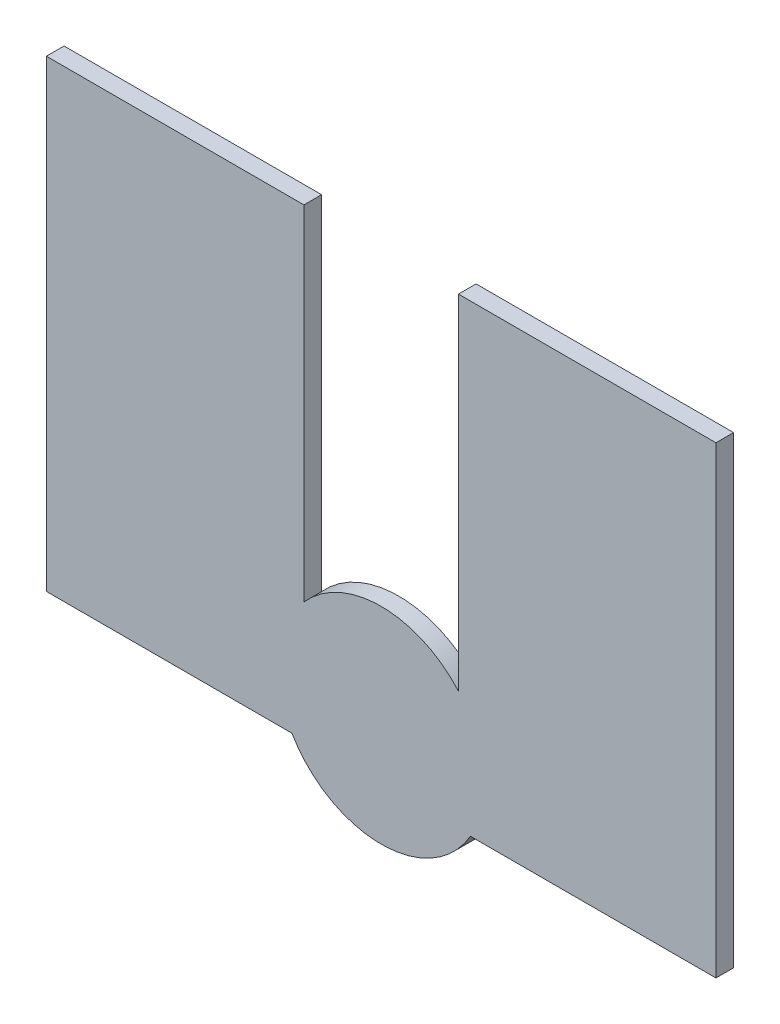
ISO-10303-21;
HEADER;
FILE_DESCRIPTION(('STEP AP214'),'2;1');
FILE_NAME('part.step','',(''),(''),'','','');
FILE_SCHEMA(('AUTOMOTIVE_DESIGN { 1 0 10303 214 1 1 1 1 }'));
ENDSEC;
DATA;
#1=APPLICATION_CONTEXT('core data for automotive mechanical design processes');
#2=APPLICATION_PROTOCOL_DEFINITION('international standard','automotive_design',2000,#1);
#3=PRODUCT_CONTEXT('',#1,'mechanical');
#4=PRODUCT('Part','Part','',(#3));
#5=PRODUCT_RELATED_PRODUCT_CATEGORY('part','',(#4));
#6=PRODUCT_DEFINITION_FORMATION('','',#4);
#7=PRODUCT_DEFINITION_CONTEXT('part definition',#1,'design');
#8=PRODUCT_DEFINITION('design','',#6,#7);
#9=PRODUCT_DEFINITION_SHAPE('','',#8);
#10=(LENGTH_UNIT() NAMED_UNIT(*) SI_UNIT(.MILLI.,.METRE.));
#11=(NAMED_UNIT(*) PLANE_ANGLE_UNIT() SI_UNIT($,.RADIAN.));
#12=(NAMED_UNIT(*) SI_UNIT($,.STERADIAN.) SOLID_ANGLE_UNIT());
#13=UNCERTAINTY_MEASURE_WITH_UNIT(LENGTH_MEASURE(1.E-05),#10,'distance_accuracy_value','');
#14=(GEOMETRIC_REPRESENTATION_CONTEXT(3) GLOBAL_UNCERTAINTY_ASSIGNED_CONTEXT((#13)) GLOBAL_UNIT_ASSIGNED_CONTEXT((#10,
#11,#12)) REPRESENTATION_CONTEXT('',''));
#15=CARTESIAN_POINT('',(0.,0.,0.));
#16=DIRECTION('',(0.,0.,1.));
#17=DIRECTION('',(1.,0.,0.));
#18=AXIS2_PLACEMENT_3D('',#15,#16,#17);
#19=CARTESIAN_POINT('',(2.200080000037,10.483340357419,0.03429));
#20=DIRECTION('',(0.,0.,1.));
#21=DIRECTION('',(1.,0.,0.));
#22=AXIS2_PLACEMENT_3D('',#19,#20,#21);
#23=PLANE('',#22);
#24=DIRECTION('',(-1.,1.04847453736E-09,0.));
#25=VECTOR('',#24,1.);
#26=CARTESIAN_POINT('',(2.026846440134,10.0499999995,0.03429));
#27=LINE('',#26,#25);
#28=CARTESIAN_POINT('',(1.55008,10.05,0.03429));
#29=VERTEX_POINT('',#28);
#30=CARTESIAN_POINT('',(2.02684644013383,10.0499999995,0.03429));
#31=VERTEX_POINT('',#30);
#32=EDGE_CURVE('E102',#29,#31,#27,.F.);
#33=ORIENTED_EDGE('',*,*,#32,.T.);
#34=CARTESIAN_POINT('',(2.200079999845,10.150000005491,0.03429));
#35=DIRECTION('',(0.,0.,1.));
#36=DIRECTION('',(1.,0.,0.));
#37=AXIS2_PLACEMENT_3D('',#34,#35,#36);
#38=CIRCLE('',#37,0.200024667);
#39=CARTESIAN_POINT('',(2.37331356099954,10.0500000020001,0.03429));
#40=VERTEX_POINT('',#39);
#41=EDGE_CURVE('E20',#40,#31,#38,.F.);
#42=ORIENTED_EDGE('',*,*,#41,.F.);
#43=DIRECTION('',(-1.,4.194926492049E-09,0.));
#44=VECTOR('',#43,1.);
#45=CARTESIAN_POINT('',(2.85008,10.05,0.03429));
#46=LINE('',#45,#44);
#47=CARTESIAN_POINT('',(2.85008,10.0500000003333,0.03429));
#48=VERTEX_POINT('',#47);
#49=EDGE_CURVE('E100',#40,#48,#46,.F.);
#50=ORIENTED_EDGE('',*,*,#49,.T.);
#51=DIRECTION('',(0.,1.,0.));
#52=VECTOR('',#51,1.);
#53=CARTESIAN_POINT('',(2.85008,10.95,0.03429));
#54=LINE('',#53,#52);
#55=CARTESIAN_POINT('',(2.85008,10.95,0.03429));
#56=VERTEX_POINT('',#55);
#57=EDGE_CURVE('E122',#48,#56,#54,.T.);
#58=ORIENTED_EDGE('',*,*,#57,.T.);
#59=DIRECTION('',(1.,0.,0.));
#60=VECTOR('',#59,1.);
#61=CARTESIAN_POINT('',(2.35008,10.95,0.03429));
#62=LINE('',#61,#60);
#63=CARTESIAN_POINT('',(2.35008,10.95,0.03429));
#64=VERTEX_POINT('',#63);
#65=EDGE_CURVE('E142',#56,#64,#62,.F.);
#66=ORIENTED_EDGE('',*,*,#65,.T.);
#67=DIRECTION('',(0.,1.,0.));
#68=VECTOR('',#67,1.);
#69=CARTESIAN_POINT('',(2.35008,10.282324849,0.03429));
#70=LINE('',#69,#68);
#71=CARTESIAN_POINT('',(2.35008,10.2823248489999,0.03429));
#72=VERTEX_POINT('',#71);
#73=EDGE_CURVE('E135',#64,#72,#70,.F.);
#74=ORIENTED_EDGE('',*,*,#73,.T.);
#75=CARTESIAN_POINT('',(2.20008,10.149999993404,0.03429));
#76=DIRECTION('',(0.,0.,1.));
#77=DIRECTION('',(1.,0.,0.));
#78=AXIS2_PLACEMENT_3D('',#75,#76,#77);
#79=CIRCLE('',#78,0.200024667);
#80=CARTESIAN_POINT('',(2.05008000000004,10.2823248489999,0.03429));
#81=VERTEX_POINT('',#80);
#82=EDGE_CURVE('E150',#81,#72,#79,.F.);
#83=ORIENTED_EDGE('',*,*,#82,.F.);
#84=DIRECTION('',(0.,1.,0.));
#85=VECTOR('',#84,1.);
#86=CARTESIAN_POINT('',(2.05008,10.95,0.03429));
#87=LINE('',#86,#85);
#88=CARTESIAN_POINT('',(2.05008,10.95,0.03429));
#89=VERTEX_POINT('',#88);
#90=EDGE_CURVE('E147',#81,#89,#87,.T.);
#91=ORIENTED_EDGE('',*,*,#90,.T.);
#92=DIRECTION('',(1.,0.,0.));
#93=VECTOR('',#92,1.);
#94=CARTESIAN_POINT('',(1.55008,10.95,0.03429));
#95=LINE('',#94,#93);
#96=CARTESIAN_POINT('',(1.55008,10.95,0.03429));
#97=VERTEX_POINT('',#96);
#98=EDGE_CURVE('E154',#89,#97,#95,.F.);
#99=ORIENTED_EDGE('',*,*,#98,.T.);
#100=DIRECTION('',(0.,1.,0.));
#101=VECTOR('',#100,1.);
#102=CARTESIAN_POINT('',(1.55008,10.05,0.03429));
#103=LINE('',#102,#101);
#104=EDGE_CURVE('E104',#97,#29,#103,.F.);
#105=ORIENTED_EDGE('',*,*,#104,.T.);
#106=EDGE_LOOP('',(#33,#42,#50,#58,#66,#74,#83,#91,#99,#105));
#107=FACE_BOUND('',#106,.T.);
#108=ADVANCED_FACE('F17',(#107),#23,.T.);
#109=CARTESIAN_POINT('',(2.85008,10.05,0.));
#110=DIRECTION('',(4.194926492049E-09,1.,0.));
#111=DIRECTION('',(-1.,4.194926492049E-09,0.));
#112=AXIS2_PLACEMENT_3D('',#109,#110,#111);
#113=PLANE('',#112);
#114=DIRECTION('',(0.,0.,1.));
#115=VECTOR('',#114,1.);
#116=CARTESIAN_POINT('',(2.3733135609996,10.0500000020002,0.));
#117=LINE('',#116,#115);
#118=CARTESIAN_POINT('',(2.37331356042228,10.0500000010001,0.));
#119=VERTEX_POINT('',#118);
#120=EDGE_CURVE('E99',#119,#40,#117,.T.);
#121=ORIENTED_EDGE('',*,*,#120,.F.);
#122=DIRECTION('',(-1.,0.,0.));
#123=VECTOR('',#122,1.);
#124=CARTESIAN_POINT('',(2.200080000037,10.05,0.));
#125=LINE('',#124,#123);
#126=CARTESIAN_POINT('',(2.85008,10.05,0.));
#127=VERTEX_POINT('',#126);
#128=EDGE_CURVE('E132',#127,#119,#125,.T.);
#129=ORIENTED_EDGE('',*,*,#128,.F.);
#130=DIRECTION('',(0.,0.,1.));
#131=VECTOR('',#130,1.);
#132=CARTESIAN_POINT('',(2.85008,10.05,0.));
#133=LINE('',#132,#131);
#134=EDGE_CURVE('E119',#127,#48,#133,.T.);
#135=ORIENTED_EDGE('',*,*,#134,.T.);
#136=ORIENTED_EDGE('',*,*,#49,.F.);
#137=EDGE_LOOP('',(#121,#129,#135,#136));
#138=FACE_BOUND('',#137,.T.);
#139=ADVANCED_FACE('F320',(#138),#113,.F.);
#140=CARTESIAN_POINT('',(2.200079999845,10.150000005491,0.));
#141=DIRECTION('',(0.,0.,1.));
#142=DIRECTION('',(1.,0.,0.));
#143=AXIS2_PLACEMENT_3D('',#140,#141,#142);
#144=CYLINDRICAL_SURFACE('',#143,0.200024667);
#145=CARTESIAN_POINT('',(2.200079999845,10.150000005491,0.));
#146=DIRECTION('',(0.,0.,1.));
#147=DIRECTION('',(1.,0.,0.));
#148=AXIS2_PLACEMENT_3D('',#145,#146,#147);
#149=CIRCLE('',#148,0.200024667);
#150=CARTESIAN_POINT('',(2.02684644013383,10.0499999995,0.));
#151=VERTEX_POINT('',#150);
#152=EDGE_CURVE('E169',#119,#151,#149,.F.);
#153=ORIENTED_EDGE('',*,*,#152,.F.);
#154=ORIENTED_EDGE('',*,*,#120,.T.);
#155=ORIENTED_EDGE('',*,*,#41,.T.);
#156=DIRECTION('',(0.,0.,1.));
#157=VECTOR('',#156,1.);
#158=CARTESIAN_POINT('',(2.026846440134,10.0499999995,0.));
#159=LINE('',#158,#157);
#160=EDGE_CURVE('E97',#31,#151,#159,.F.);
#161=ORIENTED_EDGE('',*,*,#160,.T.);
#162=EDGE_LOOP('',(#153,#154,#155,#161));
#163=FACE_BOUND('',#162,.T.);
#164=ADVANCED_FACE('F95',(#163),#144,.T.);
#165=CARTESIAN_POINT('',(2.026846440134,10.0499999995,0.));
#166=DIRECTION('',(1.04847453736E-09,1.,0.));
#167=DIRECTION('',(-1.,1.04847453736E-09,0.));
#168=AXIS2_PLACEMENT_3D('',#165,#166,#167);
#169=PLANE('',#168);
#170=DIRECTION('',(0.,0.,-1.));
#171=VECTOR('',#170,1.);
#172=CARTESIAN_POINT('',(1.55008,10.05,0.));
#173=LINE('',#172,#171);
#174=CARTESIAN_POINT('',(1.55008,10.0499999996667,0.));
#175=VERTEX_POINT('',#174);
#176=EDGE_CURVE('E107',#29,#175,#173,.T.);
#177=ORIENTED_EDGE('',*,*,#176,.T.);
#178=DIRECTION('',(-1.,0.,0.));
#179=VECTOR('',#178,1.);
#180=CARTESIAN_POINT('',(2.200080000037,10.0499999995,0.));
#181=LINE('',#180,#179);
#182=EDGE_CURVE('E111',#151,#175,#181,.T.);
#183=ORIENTED_EDGE('',*,*,#182,.F.);
#184=ORIENTED_EDGE('',*,*,#160,.F.);
#185=ORIENTED_EDGE('',*,*,#32,.F.);
#186=EDGE_LOOP('',(#177,#183,#184,#185));
#187=FACE_BOUND('',#186,.T.);
#188=ADVANCED_FACE('F109',(#187),#169,.F.);
#189=CARTESIAN_POINT('',(1.55008,10.05,0.));
#190=DIRECTION('',(1.,0.,0.));
#191=DIRECTION('',(0.,0.,-1.));
#192=AXIS2_PLACEMENT_3D('',#189,#190,#191);
#193=PLANE('',#192);
#194=DIRECTION('',(0.,0.,-1.));
#195=VECTOR('',#194,1.);
#196=CARTESIAN_POINT('',(1.55008,10.95,0.));
#197=LINE('',#196,#195);
#198=CARTESIAN_POINT('',(1.55008,10.95,0.));
#199=VERTEX_POINT('',#198);
#200=EDGE_CURVE('E156',#97,#199,#197,.T.);
#201=ORIENTED_EDGE('',*,*,#200,.T.);
#202=DIRECTION('',(0.,1.,0.));
#203=VECTOR('',#202,1.);
#204=CARTESIAN_POINT('',(1.55008,10.483340357419,0.));
#205=LINE('',#204,#203);
#206=EDGE_CURVE('E186',#175,#199,#205,.T.);
#207=ORIENTED_EDGE('',*,*,#206,.F.);
#208=ORIENTED_EDGE('',*,*,#176,.F.);
#209=ORIENTED_EDGE('',*,*,#104,.F.);
#210=EDGE_LOOP('',(#201,#207,#208,#209));
#211=FACE_BOUND('',#210,.T.);
#212=ADVANCED_FACE('F197',(#211),#193,.F.);
#213=CARTESIAN_POINT('',(1.55008,10.95,0.));
#214=DIRECTION('',(0.,-1.,0.));
#215=DIRECTION('',(0.,0.,-1.));
#216=AXIS2_PLACEMENT_3D('',#213,#214,#215);
#217=PLANE('',#216);
#218=DIRECTION('',(0.,0.,1.));
#219=VECTOR('',#218,1.);
#220=CARTESIAN_POINT('',(2.05008,10.95,0.));
#221=LINE('',#220,#219);
#222=CARTESIAN_POINT('',(2.05008,10.95,0.));
#223=VERTEX_POINT('',#222);
#224=EDGE_CURVE('E151',#89,#223,#221,.F.);
#225=ORIENTED_EDGE('',*,*,#224,.T.);
#226=DIRECTION('',(-1.,0.,0.));
#227=VECTOR('',#226,1.);
#228=CARTESIAN_POINT('',(2.200080000037,10.95,0.));
#229=LINE('',#228,#227);
#230=EDGE_CURVE('E183',#199,#223,#229,.F.);
#231=ORIENTED_EDGE('',*,*,#230,.F.);
#232=ORIENTED_EDGE('',*,*,#200,.F.);
#233=ORIENTED_EDGE('',*,*,#98,.F.);
#234=EDGE_LOOP('',(#225,#231,#232,#233));
#235=FACE_BOUND('',#234,.T.);
#236=ADVANCED_FACE('F242',(#235),#217,.F.);
#237=CARTESIAN_POINT('',(2.05008,10.95,0.));
#238=DIRECTION('',(-1.,0.,0.));
#239=DIRECTION('',(0.,0.,1.));
#240=AXIS2_PLACEMENT_3D('',#237,#238,#239);
#241=PLANE('',#240);
#242=DIRECTION('',(0.,0.,1.));
#243=VECTOR('',#242,1.);
#244=CARTESIAN_POINT('',(2.05008000000008,10.2823248489999,0.));
#245=LINE('',#244,#243);
#246=CARTESIAN_POINT('',(2.05008000000004,10.2823248489999,0.));
#247=VERTEX_POINT('',#246);
#248=EDGE_CURVE('E170',#247,#81,#245,.T.);
#249=ORIENTED_EDGE('',*,*,#248,.F.);
#250=DIRECTION('',(0.,1.,0.));
#251=VECTOR('',#250,1.);
#252=CARTESIAN_POINT('',(2.05008,10.483340357419,0.));
#253=LINE('',#252,#251);
#254=EDGE_CURVE('E168',#223,#247,#253,.F.);
#255=ORIENTED_EDGE('',*,*,#254,.F.);
#256=ORIENTED_EDGE('',*,*,#224,.F.);
#257=ORIENTED_EDGE('',*,*,#90,.F.);
#258=EDGE_LOOP('',(#249,#255,#256,#257));
#259=FACE_BOUND('',#258,.T.);
#260=ADVANCED_FACE('F231',(#259),#241,.F.);
#261=CARTESIAN_POINT('',(2.20008,10.149999993404,0.));
#262=DIRECTION('',(0.,0.,1.));
#263=DIRECTION('',(1.,0.,0.));
#264=AXIS2_PLACEMENT_3D('',#261,#262,#263);
#265=CYLINDRICAL_SURFACE('',#264,0.200024667);
#266=CARTESIAN_POINT('',(2.20008,10.149999993404,0.));
#267=DIRECTION('',(0.,0.,1.));
#268=DIRECTION('',(1.,0.,0.));
#269=AXIS2_PLACEMENT_3D('',#266,#267,#268);
#270=CIRCLE('',#269,0.200024667);
#271=CARTESIAN_POINT('',(2.35008,10.2823248489999,0.));
#272=VERTEX_POINT('',#271);
#273=EDGE_CURVE('E164',#247,#272,#270,.F.);
#274=ORIENTED_EDGE('',*,*,#273,.F.);
#275=ORIENTED_EDGE('',*,*,#248,.T.);
#276=ORIENTED_EDGE('',*,*,#82,.T.);
#277=DIRECTION('',(0.,0.,1.));
#278=VECTOR('',#277,1.);
#279=CARTESIAN_POINT('',(2.35008,10.282324849,0.));
#280=LINE('',#279,#278);
#281=EDGE_CURVE('E139',#72,#272,#280,.F.);
#282=ORIENTED_EDGE('',*,*,#281,.T.);
#283=EDGE_LOOP('',(#274,#275,#276,#282));
#284=FACE_BOUND('',#283,.T.);
#285=ADVANCED_FACE('F233',(#284),#265,.T.);
#286=CARTESIAN_POINT('',(2.35008,10.282324849,0.));
#287=DIRECTION('',(1.,0.,0.));
#288=DIRECTION('',(0.,1.,0.));
#289=AXIS2_PLACEMENT_3D('',#286,#287,#288);
#290=PLANE('',#289);
#291=DIRECTION('',(0.,0.,-1.));
#292=VECTOR('',#291,1.);
#293=CARTESIAN_POINT('',(2.35008,10.95,0.));
#294=LINE('',#293,#292);
#295=CARTESIAN_POINT('',(2.35008,10.95,0.));
#296=VERTEX_POINT('',#295);
#297=EDGE_CURVE('E138',#64,#296,#294,.T.);
#298=ORIENTED_EDGE('',*,*,#297,.T.);
#299=DIRECTION('',(0.,1.,0.));
#300=VECTOR('',#299,1.);
#301=CARTESIAN_POINT('',(2.35008,10.483340357419,0.));
#302=LINE('',#301,#300);
#303=EDGE_CURVE('E167',#272,#296,#302,.T.);
#304=ORIENTED_EDGE('',*,*,#303,.F.);
#305=ORIENTED_EDGE('',*,*,#281,.F.);
#306=ORIENTED_EDGE('',*,*,#73,.F.);
#307=EDGE_LOOP('',(#298,#304,#305,#306));
#308=FACE_BOUND('',#307,.T.);
#309=ADVANCED_FACE('F220',(#308),#290,.F.);
#310=CARTESIAN_POINT('',(2.35008,10.95,0.));
#311=DIRECTION('',(0.,-1.,0.));
#312=DIRECTION('',(0.,0.,-1.));
#313=AXIS2_PLACEMENT_3D('',#310,#311,#312);
#314=PLANE('',#313);
#315=DIRECTION('',(0.,0.,1.));
#316=VECTOR('',#315,1.);
#317=CARTESIAN_POINT('',(2.85008,10.95,0.));
#318=LINE('',#317,#316);
#319=CARTESIAN_POINT('',(2.85008,10.95,0.));
#320=VERTEX_POINT('',#319);
#321=EDGE_CURVE('E35',#56,#320,#318,.F.);
#322=ORIENTED_EDGE('',*,*,#321,.T.);
#323=DIRECTION('',(-1.,0.,0.));
#324=VECTOR('',#323,1.);
#325=CARTESIAN_POINT('',(2.200080000037,10.95,0.));
#326=LINE('',#325,#324);
#327=EDGE_CURVE('E26',#296,#320,#326,.F.);
#328=ORIENTED_EDGE('',*,*,#327,.F.);
#329=ORIENTED_EDGE('',*,*,#297,.F.);
#330=ORIENTED_EDGE('',*,*,#65,.F.);
#331=EDGE_LOOP('',(#322,#328,#329,#330));
#332=FACE_BOUND('',#331,.T.);
#333=ADVANCED_FACE('F223',(#332),#314,.F.);
#334=CARTESIAN_POINT('',(2.85008,10.95,0.));
#335=DIRECTION('',(-1.,0.,0.));
#336=DIRECTION('',(0.,0.,1.));
#337=AXIS2_PLACEMENT_3D('',#334,#335,#336);
#338=PLANE('',#337);
#339=ORIENTED_EDGE('',*,*,#134,.F.);
#340=DIRECTION('',(0.,1.,0.));
#341=VECTOR('',#340,1.);
#342=CARTESIAN_POINT('',(2.85008,10.483340357419,0.));
#343=LINE('',#342,#341);
#344=EDGE_CURVE('E11',#320,#127,#343,.F.);
#345=ORIENTED_EDGE('',*,*,#344,.F.);
#346=ORIENTED_EDGE('',*,*,#321,.F.);
#347=ORIENTED_EDGE('',*,*,#57,.F.);
#348=EDGE_LOOP('',(#339,#345,#346,#347));
#349=FACE_BOUND('',#348,.T.);
#350=ADVANCED_FACE('F245',(#349),#338,.F.);
#351=CARTESIAN_POINT('',(2.200080000037,10.483340357419,0.));
#352=DIRECTION('',(0.,0.,-1.));
#353=DIRECTION('',(-1.,0.,0.));
#354=AXIS2_PLACEMENT_3D('',#351,#352,#353);
#355=PLANE('',#354);
#356=ORIENTED_EDGE('',*,*,#327,.T.);
#357=ORIENTED_EDGE('',*,*,#344,.T.);
#358=ORIENTED_EDGE('',*,*,#128,.T.);
#359=ORIENTED_EDGE('',*,*,#152,.T.);
#360=ORIENTED_EDGE('',*,*,#182,.T.);
#361=ORIENTED_EDGE('',*,*,#206,.T.);
#362=ORIENTED_EDGE('',*,*,#230,.T.);
#363=ORIENTED_EDGE('',*,*,#254,.T.);
#364=ORIENTED_EDGE('',*,*,#273,.T.);
#365=ORIENTED_EDGE('',*,*,#303,.T.);
#366=EDGE_LOOP('',(#356,#357,#358,#359,#360,#361,#362,#363,#364,#365));
#367=FACE_BOUND('',#366,.T.);
#368=ADVANCED_FACE('F202',(#367),#355,.T.);
#369=CLOSED_SHELL('',(#108,#139,#164,#188,#212,#236,#260,#285,#309,#333,#350,#368));
#370=MANIFOLD_SOLID_BREP('B1',#369);
#371=ADVANCED_BREP_SHAPE_REPRESENTATION('',(#18,#370),#14);
#372=SHAPE_DEFINITION_REPRESENTATION(#9,#371);
ENDSEC;
END-ISO-10303-21;
